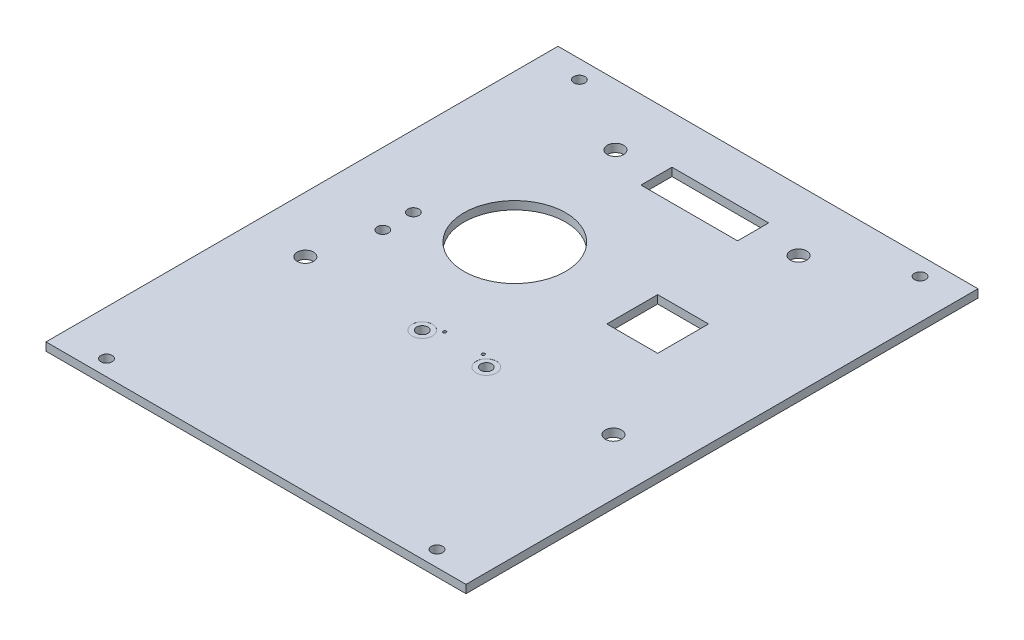
ISO-10303-21;
HEADER;
FILE_DESCRIPTION(('STEP AP214'),'2;1');
FILE_NAME('part.step','',(''),(''),'','','');
FILE_SCHEMA(('AUTOMOTIVE_DESIGN { 1 0 10303 214 1 1 1 1 }'));
ENDSEC;
DATA;
#1=APPLICATION_CONTEXT('core data for automotive mechanical design processes');
#2=APPLICATION_PROTOCOL_DEFINITION('international standard','automotive_design',2000,#1);
#3=PRODUCT_CONTEXT('',#1,'mechanical');
#4=PRODUCT('Part','Part','',(#3));
#5=PRODUCT_RELATED_PRODUCT_CATEGORY('part','',(#4));
#6=PRODUCT_DEFINITION_FORMATION('','',#4);
#7=PRODUCT_DEFINITION_CONTEXT('part definition',#1,'design');
#8=PRODUCT_DEFINITION('design','',#6,#7);
#9=PRODUCT_DEFINITION_SHAPE('','',#8);
#10=(LENGTH_UNIT() NAMED_UNIT(*) SI_UNIT(.MILLI.,.METRE.));
#11=(NAMED_UNIT(*) PLANE_ANGLE_UNIT() SI_UNIT($,.RADIAN.));
#12=(NAMED_UNIT(*) SI_UNIT($,.STERADIAN.) SOLID_ANGLE_UNIT());
#13=UNCERTAINTY_MEASURE_WITH_UNIT(LENGTH_MEASURE(1.E-05),#10,'distance_accuracy_value','');
#14=(GEOMETRIC_REPRESENTATION_CONTEXT(3) GLOBAL_UNCERTAINTY_ASSIGNED_CONTEXT((#13)) GLOBAL_UNIT_ASSIGNED_CONTEXT((#10,
#11,#12)) REPRESENTATION_CONTEXT('',''));
#15=CARTESIAN_POINT('',(0.,0.,0.));
#16=DIRECTION('',(0.,0.,1.));
#17=DIRECTION('',(1.,0.,0.));
#18=AXIS2_PLACEMENT_3D('',#15,#16,#17);
#19=CARTESIAN_POINT('',(17.44,-8.4,30.2374526378947));
#20=DIRECTION('',(0.,1.,0.));
#21=DIRECTION('',(0.,0.,1.));
#22=AXIS2_PLACEMENT_3D('',#19,#20,#21);
#23=CYLINDRICAL_SURFACE('',#22,1.1);
#24=CARTESIAN_POINT('',(17.44,0.,30.2374526378947));
#25=DIRECTION('',(0.,-1.,0.));
#26=DIRECTION('',(0.,0.,-1.));
#27=AXIS2_PLACEMENT_3D('',#24,#25,#26);
#28=CIRCLE('',#27,1.1);
#29=CARTESIAN_POINT('',(17.44,0.,29.1374526378947));
#30=VERTEX_POINT('',#29);
#31=EDGE_CURVE('E261',#30,#30,#28,.T.);
#32=ORIENTED_EDGE('',*,*,#31,.T.);
#33=EDGE_LOOP('',(#32));
#34=FACE_BOUND('',#33,.T.);
#35=CARTESIAN_POINT('',(17.44,1.59,30.2374526378947));
#36=DIRECTION('',(0.,1.,0.));
#37=DIRECTION('',(0.,0.,1.));
#38=AXIS2_PLACEMENT_3D('',#35,#36,#37);
#39=CIRCLE('',#38,1.1);
#40=CARTESIAN_POINT('',(17.44,1.59,31.3374526378947));
#41=VERTEX_POINT('',#40);
#42=EDGE_CURVE('E265',#41,#41,#39,.F.);
#43=ORIENTED_EDGE('',*,*,#42,.F.);
#44=EDGE_LOOP('',(#43));
#45=FACE_BOUND('',#44,.T.);
#46=ADVANCED_FACE('F34',(#34,#45),#23,.F.);
#47=CARTESIAN_POINT('',(30.04,-8.4,30.2374526378947));
#48=DIRECTION('',(0.,1.,0.));
#49=DIRECTION('',(0.,0.,1.));
#50=AXIS2_PLACEMENT_3D('',#47,#48,#49);
#51=CYLINDRICAL_SURFACE('',#50,1.1);
#52=CARTESIAN_POINT('',(30.04,0.,30.2374526378947));
#53=DIRECTION('',(0.,-1.,0.));
#54=DIRECTION('',(0.,0.,-1.));
#55=AXIS2_PLACEMENT_3D('',#52,#53,#54);
#56=CIRCLE('',#55,1.1);
#57=CARTESIAN_POINT('',(30.04,0.,29.1374526378947));
#58=VERTEX_POINT('',#57);
#59=EDGE_CURVE('E264',#58,#58,#56,.T.);
#60=ORIENTED_EDGE('',*,*,#59,.T.);
#61=EDGE_LOOP('',(#60));
#62=FACE_BOUND('',#61,.T.);
#63=CARTESIAN_POINT('',(30.04,1.59,30.2374526378947));
#64=DIRECTION('',(0.,1.,0.));
#65=DIRECTION('',(0.,0.,1.));
#66=AXIS2_PLACEMENT_3D('',#63,#64,#65);
#67=CIRCLE('',#66,1.1);
#68=CARTESIAN_POINT('',(30.04,1.59,31.3374526378947));
#69=VERTEX_POINT('',#68);
#70=EDGE_CURVE('E269',#69,#69,#67,.F.);
#71=ORIENTED_EDGE('',*,*,#70,.F.);
#72=EDGE_LOOP('',(#71));
#73=FACE_BOUND('',#72,.T.);
#74=ADVANCED_FACE('F342',(#62,#73),#51,.F.);
#75=CARTESIAN_POINT('',(0.,1.6,0.));
#76=DIRECTION('',(0.,-1.,0.));
#77=DIRECTION('',(0.,0.,-1.));
#78=AXIS2_PLACEMENT_3D('',#75,#76,#77);
#79=PLANE('',#78);
#80=CARTESIAN_POINT('',(-3.50999999999996,1.6,11.0374526378947));
#81=DIRECTION('',(0.,1.,0.));
#82=DIRECTION('',(0.,0.,1.));
#83=AXIS2_PLACEMENT_3D('',#80,#81,#82);
#84=CIRCLE('',#83,1.1);
#85=CARTESIAN_POINT('',(-3.50999999999996,1.6,12.1374526378947));
#86=VERTEX_POINT('',#85);
#87=EDGE_CURVE('E276',#86,#86,#84,.T.);
#88=ORIENTED_EDGE('',*,*,#87,.F.);
#89=EDGE_LOOP('',(#88));
#90=FACE_BOUND('',#89,.T.);
#91=CARTESIAN_POINT('',(-3.50999999999996,1.6,17.0374526378947));
#92=DIRECTION('',(0.,1.,0.));
#93=DIRECTION('',(0.,0.,1.));
#94=AXIS2_PLACEMENT_3D('',#91,#92,#93);
#95=CIRCLE('',#94,1.1);
#96=CARTESIAN_POINT('',(-3.50999999999996,1.6,18.1374526378947));
#97=VERTEX_POINT('',#96);
#98=EDGE_CURVE('E282',#97,#97,#95,.T.);
#99=ORIENTED_EDGE('',*,*,#98,.F.);
#100=EDGE_LOOP('',(#99));
#101=FACE_BOUND('',#100,.T.);
#102=CARTESIAN_POINT('',(30.04,1.6,30.2374526378947));
#103=DIRECTION('',(0.,1.,0.));
#104=DIRECTION('',(0.,0.,1.));
#105=AXIS2_PLACEMENT_3D('',#102,#103,#104);
#106=CIRCLE('',#105,2.);
#107=CARTESIAN_POINT('',(30.04,1.6,32.2374526378947));
#108=VERTEX_POINT('',#107);
#109=EDGE_CURVE('E291',#108,#108,#106,.T.);
#110=ORIENTED_EDGE('',*,*,#109,.F.);
#111=EDGE_LOOP('',(#110));
#112=FACE_BOUND('',#111,.T.);
#113=CARTESIAN_POINT('',(17.44,1.6,30.2374526378947));
#114=DIRECTION('',(0.,1.,0.));
#115=DIRECTION('',(0.,0.,1.));
#116=AXIS2_PLACEMENT_3D('',#113,#114,#115);
#117=CIRCLE('',#116,2.);
#118=CARTESIAN_POINT('',(17.44,1.6,32.2374526378947));
#119=VERTEX_POINT('',#118);
#120=EDGE_CURVE('E280',#119,#119,#117,.T.);
#121=ORIENTED_EDGE('',*,*,#120,.F.);
#122=EDGE_LOOP('',(#121));
#123=FACE_BOUND('',#122,.T.);
#124=CARTESIAN_POINT('',(27.54,1.6,28.3374526378947));
#125=DIRECTION('',(0.,1.,0.));
#126=DIRECTION('',(0.,0.,1.));
#127=AXIS2_PLACEMENT_3D('',#124,#125,#126);
#128=CIRCLE('',#127,0.300000000000001);
#129=CARTESIAN_POINT('',(27.54,1.6,28.6374526378947));
#130=VERTEX_POINT('',#129);
#131=EDGE_CURVE('E257',#130,#130,#128,.T.);
#132=ORIENTED_EDGE('',*,*,#131,.F.);
#133=EDGE_LOOP('',(#132));
#134=FACE_BOUND('',#133,.T.);
#135=CARTESIAN_POINT('',(19.94,1.6,28.3374526378947));
#136=DIRECTION('',(0.,1.,0.));
#137=DIRECTION('',(0.,0.,1.));
#138=AXIS2_PLACEMENT_3D('',#135,#136,#137);
#139=CIRCLE('',#138,0.300000000000001);
#140=CARTESIAN_POINT('',(19.94,1.6,28.6374526378947));
#141=VERTEX_POINT('',#140);
#142=EDGE_CURVE('E268',#141,#141,#139,.T.);
#143=ORIENTED_EDGE('',*,*,#142,.F.);
#144=EDGE_LOOP('',(#143));
#145=FACE_BOUND('',#144,.T.);
#146=CARTESIAN_POINT('',(5.74000000000004,1.6,-19.4625473621052));
#147=DIRECTION('',(0.,-1.,0.));
#148=DIRECTION('',(0.,0.,-1.));
#149=AXIS2_PLACEMENT_3D('',#146,#147,#148);
#150=CIRCLE('',#149,1.6);
#151=CARTESIAN_POINT('',(5.74000000000004,1.6,-21.0625473621052));
#152=VERTEX_POINT('',#151);
#153=EDGE_CURVE('E305',#152,#152,#150,.T.);
#154=ORIENTED_EDGE('',*,*,#153,.T.);
#155=EDGE_LOOP('',(#154));
#156=FACE_BOUND('',#155,.T.);
#157=CARTESIAN_POINT('',(41.74,1.6,-19.4625473621052));
#158=DIRECTION('',(0.,-1.,0.));
#159=DIRECTION('',(0.,0.,-1.));
#160=AXIS2_PLACEMENT_3D('',#157,#158,#159);
#161=CIRCLE('',#160,1.6);
#162=CARTESIAN_POINT('',(41.74,1.6,-21.0625473621052));
#163=VERTEX_POINT('',#162);
#164=EDGE_CURVE('E311',#163,#163,#161,.T.);
#165=ORIENTED_EDGE('',*,*,#164,.T.);
#166=EDGE_LOOP('',(#165));
#167=FACE_BOUND('',#166,.T.);
#168=CARTESIAN_POINT('',(-6.55999999999996,1.6,29.2374526378947));
#169=DIRECTION('',(0.,-1.,0.));
#170=DIRECTION('',(0.,0.,-1.));
#171=AXIS2_PLACEMENT_3D('',#168,#169,#170);
#172=CIRCLE('',#171,1.60000000000001);
#173=CARTESIAN_POINT('',(-6.55999999999996,1.6,27.6374526378947));
#174=VERTEX_POINT('',#173);
#175=EDGE_CURVE('E317',#174,#174,#172,.T.);
#176=ORIENTED_EDGE('',*,*,#175,.T.);
#177=EDGE_LOOP('',(#176));
#178=FACE_BOUND('',#177,.T.);
#179=CARTESIAN_POINT('',(54.04,1.6,29.2374526378947));
#180=DIRECTION('',(0.,-1.,0.));
#181=DIRECTION('',(0.,0.,-1.));
#182=AXIS2_PLACEMENT_3D('',#179,#180,#181);
#183=CIRCLE('',#182,1.6);
#184=CARTESIAN_POINT('',(54.04,1.6,27.6374526378947));
#185=VERTEX_POINT('',#184);
#186=EDGE_CURVE('E149',#185,#185,#183,.T.);
#187=ORIENTED_EDGE('',*,*,#186,.T.);
#188=EDGE_LOOP('',(#187));
#189=FACE_BOUND('',#188,.T.);
#190=DIRECTION('',(-1.,0.,0.));
#191=VECTOR('',#190,1.);
#192=CARTESIAN_POINT('',(33.24,1.6,-15.9775473621052));
#193=LINE('',#192,#191);
#194=CARTESIAN_POINT('',(33.24,1.6,-15.9775473621052));
#195=VERTEX_POINT('',#194);
#196=CARTESIAN_POINT('',(14.24,1.6,-15.9775473621052));
#197=VERTEX_POINT('',#196);
#198=EDGE_CURVE('E133',#195,#197,#193,.T.);
#199=ORIENTED_EDGE('',*,*,#198,.T.);
#200=DIRECTION('',(0.,0.,-1.));
#201=VECTOR('',#200,1.);
#202=CARTESIAN_POINT('',(14.24,1.6,-15.9775473621052));
#203=LINE('',#202,#201);
#204=CARTESIAN_POINT('',(14.24,1.6,-22.0775473621052));
#205=VERTEX_POINT('',#204);
#206=EDGE_CURVE('E127',#197,#205,#203,.T.);
#207=ORIENTED_EDGE('',*,*,#206,.T.);
#208=DIRECTION('',(1.,0.,0.));
#209=VECTOR('',#208,1.);
#210=CARTESIAN_POINT('',(33.24,1.6,-22.0775473621052));
#211=LINE('',#210,#209);
#212=CARTESIAN_POINT('',(33.24,1.6,-22.0775473621052));
#213=VERTEX_POINT('',#212);
#214=EDGE_CURVE('E136',#205,#213,#211,.T.);
#215=ORIENTED_EDGE('',*,*,#214,.T.);
#216=DIRECTION('',(0.,0.,1.));
#217=VECTOR('',#216,1.);
#218=CARTESIAN_POINT('',(33.24,1.6,-15.9775473621052));
#219=LINE('',#218,#217);
#220=EDGE_CURVE('E51',#213,#195,#219,.T.);
#221=ORIENTED_EDGE('',*,*,#220,.T.);
#222=EDGE_LOOP('',(#199,#207,#215,#221));
#223=FACE_BOUND('',#222,.T.);
#224=DIRECTION('',(-1.,0.,0.));
#225=VECTOR('',#224,1.);
#226=CARTESIAN_POINT('',(0.,1.6,11.0374526378948));
#227=LINE('',#226,#225);
#228=CARTESIAN_POINT('',(44.54,1.6,11.0374526378948));
#229=VERTEX_POINT('',#228);
#230=CARTESIAN_POINT('',(34.54,1.6,11.0374526378948));
#231=VERTEX_POINT('',#230);
#232=EDGE_CURVE('E190',#229,#231,#227,.T.);
#233=ORIENTED_EDGE('',*,*,#232,.T.);
#234=DIRECTION('',(0.,0.,-1.));
#235=VECTOR('',#234,1.);
#236=CARTESIAN_POINT('',(34.54,1.6,0.));
#237=LINE('',#236,#235);
#238=CARTESIAN_POINT('',(34.54,1.6,1.03745263789475));
#239=VERTEX_POINT('',#238);
#240=EDGE_CURVE('E193',#231,#239,#237,.T.);
#241=ORIENTED_EDGE('',*,*,#240,.T.);
#242=DIRECTION('',(1.,0.,0.));
#243=VECTOR('',#242,1.);
#244=CARTESIAN_POINT('',(0.,1.6,1.03745263789474));
#245=LINE('',#244,#243);
#246=CARTESIAN_POINT('',(44.54,1.6,1.03745263789475));
#247=VERTEX_POINT('',#246);
#248=EDGE_CURVE('E178',#239,#247,#245,.T.);
#249=ORIENTED_EDGE('',*,*,#248,.T.);
#250=DIRECTION('',(0.,0.,1.));
#251=VECTOR('',#250,1.);
#252=CARTESIAN_POINT('',(44.54,1.6,0.));
#253=LINE('',#252,#251);
#254=EDGE_CURVE('E187',#247,#229,#253,.T.);
#255=ORIENTED_EDGE('',*,*,#254,.T.);
#256=EDGE_LOOP('',(#233,#241,#249,#255));
#257=FACE_BOUND('',#256,.T.);
#258=CARTESIAN_POINT('',(-8.75999999999998,1.6,66.1374526378947));
#259=DIRECTION('',(0.,1.,0.));
#260=DIRECTION('',(0.,0.,1.));
#261=AXIS2_PLACEMENT_3D('',#258,#259,#260);
#262=CIRCLE('',#261,1.1);
#263=CARTESIAN_POINT('',(-8.75999999999998,1.6,67.2374526378947));
#264=VERTEX_POINT('',#263);
#265=EDGE_CURVE('E215',#264,#264,#262,.T.);
#266=ORIENTED_EDGE('',*,*,#265,.F.);
#267=EDGE_LOOP('',(#266));
#268=FACE_BOUND('',#267,.T.);
#269=CARTESIAN_POINT('',(56.24,1.6,66.1374526378947));
#270=DIRECTION('',(0.,1.,0.));
#271=DIRECTION('',(0.,0.,1.));
#272=AXIS2_PLACEMENT_3D('',#269,#270,#271);
#273=CIRCLE('',#272,1.1);
#274=CARTESIAN_POINT('',(56.24,1.6,67.2374526378947));
#275=VERTEX_POINT('',#274);
#276=EDGE_CURVE('E223',#275,#275,#273,.T.);
#277=ORIENTED_EDGE('',*,*,#276,.F.);
#278=EDGE_LOOP('',(#277));
#279=FACE_BOUND('',#278,.T.);
#280=CARTESIAN_POINT('',(11.54,1.6,6.13745263789474));
#281=DIRECTION('',(0.,-1.,0.));
#282=DIRECTION('',(0.,0.,-1.));
#283=AXIS2_PLACEMENT_3D('',#280,#281,#282);
#284=CIRCLE('',#283,10.);
#285=CARTESIAN_POINT('',(11.54,1.6,-3.86254736210526));
#286=VERTEX_POINT('',#285);
#287=EDGE_CURVE('E240',#286,#286,#284,.T.);
#288=ORIENTED_EDGE('',*,*,#287,.T.);
#289=EDGE_LOOP('',(#288));
#290=FACE_BOUND('',#289,.T.);
#291=CARTESIAN_POINT('',(57.24,1.6,-27.8625473621053));
#292=DIRECTION('',(0.,1.,0.));
#293=DIRECTION('',(0.,0.,1.));
#294=AXIS2_PLACEMENT_3D('',#291,#292,#293);
#295=CIRCLE('',#294,1.1);
#296=CARTESIAN_POINT('',(57.24,1.6,-26.7625473621053));
#297=VERTEX_POINT('',#296);
#298=EDGE_CURVE('E243',#297,#297,#295,.T.);
#299=ORIENTED_EDGE('',*,*,#298,.F.);
#300=EDGE_LOOP('',(#299));
#301=FACE_BOUND('',#300,.T.);
#302=CARTESIAN_POINT('',(-9.75999999999997,1.6,-27.8625473621053));
#303=DIRECTION('',(0.,1.,0.));
#304=DIRECTION('',(0.,0.,1.));
#305=AXIS2_PLACEMENT_3D('',#302,#303,#304);
#306=CIRCLE('',#305,1.1);
#307=CARTESIAN_POINT('',(-9.75999999999997,1.6,-26.7625473621053));
#308=VERTEX_POINT('',#307);
#309=EDGE_CURVE('E43',#308,#308,#306,.T.);
#310=ORIENTED_EDGE('',*,*,#309,.F.);
#311=EDGE_LOOP('',(#310));
#312=FACE_BOUND('',#311,.T.);
#313=DIRECTION('',(1.,0.,0.));
#314=VECTOR('',#313,1.);
#315=CARTESIAN_POINT('',(-17.76,1.6,-31.4625473621053));
#316=LINE('',#315,#314);
#317=CARTESIAN_POINT('',(-17.56,1.6,-31.4625473621053));
#318=VERTEX_POINT('',#317);
#319=CARTESIAN_POINT('',(65.04,1.6,-31.4625473621052));
#320=VERTEX_POINT('',#319);
#321=EDGE_CURVE('E234',#318,#320,#316,.T.);
#322=ORIENTED_EDGE('',*,*,#321,.F.);
#323=DIRECTION('',(0.,0.,1.));
#324=VECTOR('',#323,1.);
#325=CARTESIAN_POINT('',(-17.56,1.6,69.2374526378947));
#326=LINE('',#325,#324);
#327=CARTESIAN_POINT('',(-17.56,1.6,69.2374526378947));
#328=VERTEX_POINT('',#327);
#329=EDGE_CURVE('E197',#318,#328,#326,.T.);
#330=ORIENTED_EDGE('',*,*,#329,.T.);
#331=DIRECTION('',(-1.,0.,0.));
#332=VECTOR('',#331,1.);
#333=CARTESIAN_POINT('',(65.24,1.6,69.2374526378947));
#334=LINE('',#333,#332);
#335=CARTESIAN_POINT('',(65.04,1.6,69.2374526378947));
#336=VERTEX_POINT('',#335);
#337=EDGE_CURVE('E229',#336,#328,#334,.T.);
#338=ORIENTED_EDGE('',*,*,#337,.F.);
#339=DIRECTION('',(0.,0.,-1.));
#340=VECTOR('',#339,1.);
#341=CARTESIAN_POINT('',(65.04,1.6,-31.4625473621052));
#342=LINE('',#341,#340);
#343=EDGE_CURVE('E207',#336,#320,#342,.T.);
#344=ORIENTED_EDGE('',*,*,#343,.T.);
#345=EDGE_LOOP('',(#322,#330,#338,#344));
#346=FACE_BOUND('',#345,.T.);
#347=ADVANCED_FACE('F140',(#90,#101,#112,#123,#134,#145,#156,#167,#178,#189,#223,#257,#268,#279,
#290,#301,#312,#346),#79,.F.);
#348=CARTESIAN_POINT('',(0.,0.,0.));
#349=DIRECTION('',(0.,-1.,0.));
#350=DIRECTION('',(0.,0.,-1.));
#351=AXIS2_PLACEMENT_3D('',#348,#349,#350);
#352=PLANE('',#351);
#353=CARTESIAN_POINT('',(-3.50999999999996,0.,11.0374526378947));
#354=DIRECTION('',(0.,-1.,0.));
#355=DIRECTION('',(0.,0.,-1.));
#356=AXIS2_PLACEMENT_3D('',#353,#354,#355);
#357=CIRCLE('',#356,1.1);
#358=CARTESIAN_POINT('',(-3.50999999999996,0.,9.93745263789475));
#359=VERTEX_POINT('',#358);
#360=EDGE_CURVE('E38',#359,#359,#357,.T.);
#361=ORIENTED_EDGE('',*,*,#360,.F.);
#362=EDGE_LOOP('',(#361));
#363=FACE_BOUND('',#362,.T.);
#364=CARTESIAN_POINT('',(-3.50999999999996,0.,17.0374526378947));
#365=DIRECTION('',(0.,-1.,0.));
#366=DIRECTION('',(0.,0.,-1.));
#367=AXIS2_PLACEMENT_3D('',#364,#365,#366);
#368=CIRCLE('',#367,1.1);
#369=CARTESIAN_POINT('',(-3.50999999999996,0.,15.9374526378947));
#370=VERTEX_POINT('',#369);
#371=EDGE_CURVE('E274',#370,#370,#368,.T.);
#372=ORIENTED_EDGE('',*,*,#371,.F.);
#373=EDGE_LOOP('',(#372));
#374=FACE_BOUND('',#373,.T.);
#375=ORIENTED_EDGE('',*,*,#59,.F.);
#376=EDGE_LOOP('',(#375));
#377=FACE_BOUND('',#376,.T.);
#378=ORIENTED_EDGE('',*,*,#31,.F.);
#379=EDGE_LOOP('',(#378));
#380=FACE_BOUND('',#379,.T.);
#381=CARTESIAN_POINT('',(27.54,0.,28.3374526378947));
#382=DIRECTION('',(0.,-1.,0.));
#383=DIRECTION('',(0.,0.,-1.));
#384=AXIS2_PLACEMENT_3D('',#381,#382,#383);
#385=CIRCLE('',#384,0.300000000000001);
#386=CARTESIAN_POINT('',(27.54,0.,28.0374526378947));
#387=VERTEX_POINT('',#386);
#388=EDGE_CURVE('E256',#387,#387,#385,.T.);
#389=ORIENTED_EDGE('',*,*,#388,.F.);
#390=EDGE_LOOP('',(#389));
#391=FACE_BOUND('',#390,.T.);
#392=CARTESIAN_POINT('',(19.94,0.,28.3374526378947));
#393=DIRECTION('',(0.,-1.,0.));
#394=DIRECTION('',(0.,0.,-1.));
#395=AXIS2_PLACEMENT_3D('',#392,#393,#394);
#396=CIRCLE('',#395,0.300000000000001);
#397=CARTESIAN_POINT('',(19.94,0.,28.0374526378947));
#398=VERTEX_POINT('',#397);
#399=EDGE_CURVE('E253',#398,#398,#396,.T.);
#400=ORIENTED_EDGE('',*,*,#399,.F.);
#401=EDGE_LOOP('',(#400));
#402=FACE_BOUND('',#401,.T.);
#403=CARTESIAN_POINT('',(5.74000000000004,0.,-19.4625473621052));
#404=DIRECTION('',(0.,-1.,0.));
#405=DIRECTION('',(0.,0.,-1.));
#406=AXIS2_PLACEMENT_3D('',#403,#404,#405);
#407=CIRCLE('',#406,1.6);
#408=CARTESIAN_POINT('',(5.74000000000004,0.,-21.0625473621052));
#409=VERTEX_POINT('',#408);
#410=EDGE_CURVE('E260',#409,#409,#407,.T.);
#411=ORIENTED_EDGE('',*,*,#410,.F.);
#412=EDGE_LOOP('',(#411));
#413=FACE_BOUND('',#412,.T.);
#414=CARTESIAN_POINT('',(41.74,0.,-19.4625473621052));
#415=DIRECTION('',(0.,-1.,0.));
#416=DIRECTION('',(0.,0.,-1.));
#417=AXIS2_PLACEMENT_3D('',#414,#415,#416);
#418=CIRCLE('',#417,1.6);
#419=CARTESIAN_POINT('',(41.74,0.,-21.0625473621052));
#420=VERTEX_POINT('',#419);
#421=EDGE_CURVE('E308',#420,#420,#418,.T.);
#422=ORIENTED_EDGE('',*,*,#421,.F.);
#423=EDGE_LOOP('',(#422));
#424=FACE_BOUND('',#423,.T.);
#425=CARTESIAN_POINT('',(-6.55999999999996,0.,29.2374526378947));
#426=DIRECTION('',(0.,-1.,0.));
#427=DIRECTION('',(0.,0.,-1.));
#428=AXIS2_PLACEMENT_3D('',#425,#426,#427);
#429=CIRCLE('',#428,1.60000000000001);
#430=CARTESIAN_POINT('',(-6.55999999999996,0.,27.6374526378947));
#431=VERTEX_POINT('',#430);
#432=EDGE_CURVE('E314',#431,#431,#429,.T.);
#433=ORIENTED_EDGE('',*,*,#432,.F.);
#434=EDGE_LOOP('',(#433));
#435=FACE_BOUND('',#434,.T.);
#436=CARTESIAN_POINT('',(54.04,0.,29.2374526378947));
#437=DIRECTION('',(0.,-1.,0.));
#438=DIRECTION('',(0.,0.,-1.));
#439=AXIS2_PLACEMENT_3D('',#436,#437,#438);
#440=CIRCLE('',#439,1.6);
#441=CARTESIAN_POINT('',(54.04,0.,27.6374526378947));
#442=VERTEX_POINT('',#441);
#443=EDGE_CURVE('E319',#442,#442,#440,.T.);
#444=ORIENTED_EDGE('',*,*,#443,.F.);
#445=EDGE_LOOP('',(#444));
#446=FACE_BOUND('',#445,.T.);
#447=DIRECTION('',(0.,0.,-1.));
#448=VECTOR('',#447,1.);
#449=CARTESIAN_POINT('',(14.24,0.,-15.9775473621052));
#450=LINE('',#449,#448);
#451=CARTESIAN_POINT('',(14.24,0.,-15.9775473621052));
#452=VERTEX_POINT('',#451);
#453=CARTESIAN_POINT('',(14.24,0.,-22.0775473621052));
#454=VERTEX_POINT('',#453);
#455=EDGE_CURVE('E59',#452,#454,#450,.T.);
#456=ORIENTED_EDGE('',*,*,#455,.F.);
#457=DIRECTION('',(-1.,0.,0.));
#458=VECTOR('',#457,1.);
#459=CARTESIAN_POINT('',(33.24,0.,-15.9775473621052));
#460=LINE('',#459,#458);
#461=CARTESIAN_POINT('',(33.24,0.,-15.9775473621052));
#462=VERTEX_POINT('',#461);
#463=EDGE_CURVE('E143',#462,#452,#460,.T.);
#464=ORIENTED_EDGE('',*,*,#463,.F.);
#465=DIRECTION('',(0.,0.,1.));
#466=VECTOR('',#465,1.);
#467=CARTESIAN_POINT('',(33.24,0.,-15.9775473621052));
#468=LINE('',#467,#466);
#469=CARTESIAN_POINT('',(33.24,0.,-22.0775473621052));
#470=VERTEX_POINT('',#469);
#471=EDGE_CURVE('E146',#470,#462,#468,.T.);
#472=ORIENTED_EDGE('',*,*,#471,.F.);
#473=DIRECTION('',(1.,0.,0.));
#474=VECTOR('',#473,1.);
#475=CARTESIAN_POINT('',(33.24,0.,-22.0775473621052));
#476=LINE('',#475,#474);
#477=EDGE_CURVE('E155',#454,#470,#476,.T.);
#478=ORIENTED_EDGE('',*,*,#477,.F.);
#479=EDGE_LOOP('',(#456,#464,#472,#478));
#480=FACE_BOUND('',#479,.T.);
#481=DIRECTION('',(0.,0.,-1.));
#482=VECTOR('',#481,1.);
#483=CARTESIAN_POINT('',(34.54,0.,1.03745263789475));
#484=LINE('',#483,#482);
#485=CARTESIAN_POINT('',(34.54,0.,11.0374526378948));
#486=VERTEX_POINT('',#485);
#487=CARTESIAN_POINT('',(34.54,0.,1.03745263789475));
#488=VERTEX_POINT('',#487);
#489=EDGE_CURVE('E161',#486,#488,#484,.T.);
#490=ORIENTED_EDGE('',*,*,#489,.F.);
#491=DIRECTION('',(-1.,0.,0.));
#492=VECTOR('',#491,1.);
#493=CARTESIAN_POINT('',(44.54,0.,11.0374526378948));
#494=LINE('',#493,#492);
#495=CARTESIAN_POINT('',(44.54,0.,11.0374526378948));
#496=VERTEX_POINT('',#495);
#497=EDGE_CURVE('E172',#496,#486,#494,.T.);
#498=ORIENTED_EDGE('',*,*,#497,.F.);
#499=DIRECTION('',(0.,0.,1.));
#500=VECTOR('',#499,1.);
#501=CARTESIAN_POINT('',(44.54,0.,1.03745263789475));
#502=LINE('',#501,#500);
#503=CARTESIAN_POINT('',(44.54,0.,1.03745263789475));
#504=VERTEX_POINT('',#503);
#505=EDGE_CURVE('E169',#504,#496,#502,.T.);
#506=ORIENTED_EDGE('',*,*,#505,.F.);
#507=DIRECTION('',(1.,0.,0.));
#508=VECTOR('',#507,1.);
#509=CARTESIAN_POINT('',(44.54,0.,1.03745263789475));
#510=LINE('',#509,#508);
#511=EDGE_CURVE('E166',#488,#504,#510,.T.);
#512=ORIENTED_EDGE('',*,*,#511,.F.);
#513=EDGE_LOOP('',(#490,#498,#506,#512));
#514=FACE_BOUND('',#513,.T.);
#515=DIRECTION('',(0.,0.,1.));
#516=VECTOR('',#515,1.);
#517=CARTESIAN_POINT('',(-17.56,0.,69.2374526378947));
#518=LINE('',#517,#516);
#519=CARTESIAN_POINT('',(-17.56,0.,-31.4625473621053));
#520=VERTEX_POINT('',#519);
#521=CARTESIAN_POINT('',(-17.56,0.,69.2374526378947));
#522=VERTEX_POINT('',#521);
#523=EDGE_CURVE('E196',#520,#522,#518,.T.);
#524=ORIENTED_EDGE('',*,*,#523,.F.);
#525=DIRECTION('',(-1.,0.,0.));
#526=VECTOR('',#525,1.);
#527=CARTESIAN_POINT('',(-17.76,0.,-31.4625473621053));
#528=LINE('',#527,#526);
#529=CARTESIAN_POINT('',(65.04,0.,-31.4625473621052));
#530=VERTEX_POINT('',#529);
#531=EDGE_CURVE('E236',#530,#520,#528,.T.);
#532=ORIENTED_EDGE('',*,*,#531,.F.);
#533=DIRECTION('',(0.,0.,-1.));
#534=VECTOR('',#533,1.);
#535=CARTESIAN_POINT('',(65.04,0.,-31.4625473621052));
#536=LINE('',#535,#534);
#537=CARTESIAN_POINT('',(65.04,0.,69.2374526378947));
#538=VERTEX_POINT('',#537);
#539=EDGE_CURVE('E205',#538,#530,#536,.T.);
#540=ORIENTED_EDGE('',*,*,#539,.F.);
#541=DIRECTION('',(1.,0.,0.));
#542=VECTOR('',#541,1.);
#543=CARTESIAN_POINT('',(65.24,0.,69.2374526378947));
#544=LINE('',#543,#542);
#545=EDGE_CURVE('E232',#522,#538,#544,.T.);
#546=ORIENTED_EDGE('',*,*,#545,.F.);
#547=EDGE_LOOP('',(#524,#532,#540,#546));
#548=FACE_BOUND('',#547,.T.);
#549=CARTESIAN_POINT('',(-8.75999999999998,0.,66.1374526378947));
#550=DIRECTION('',(0.,1.,0.));
#551=DIRECTION('',(0.,0.,1.));
#552=AXIS2_PLACEMENT_3D('',#549,#550,#551);
#553=CIRCLE('',#552,1.1);
#554=CARTESIAN_POINT('',(-8.75999999999998,0.,67.2374526378947));
#555=VERTEX_POINT('',#554);
#556=EDGE_CURVE('E220',#555,#555,#553,.T.);
#557=ORIENTED_EDGE('',*,*,#556,.T.);
#558=EDGE_LOOP('',(#557));
#559=FACE_BOUND('',#558,.T.);
#560=CARTESIAN_POINT('',(56.24,0.,66.1374526378947));
#561=DIRECTION('',(0.,1.,0.));
#562=DIRECTION('',(0.,0.,1.));
#563=AXIS2_PLACEMENT_3D('',#560,#561,#562);
#564=CIRCLE('',#563,1.1);
#565=CARTESIAN_POINT('',(56.24,0.,67.2374526378947));
#566=VERTEX_POINT('',#565);
#567=EDGE_CURVE('E226',#566,#566,#564,.T.);
#568=ORIENTED_EDGE('',*,*,#567,.T.);
#569=EDGE_LOOP('',(#568));
#570=FACE_BOUND('',#569,.T.);
#571=CARTESIAN_POINT('',(11.54,0.,6.13745263789474));
#572=DIRECTION('',(0.,-1.,0.));
#573=DIRECTION('',(0.,0.,-1.));
#574=AXIS2_PLACEMENT_3D('',#571,#572,#573);
#575=CIRCLE('',#574,10.);
#576=CARTESIAN_POINT('',(11.54,0.,-3.86254736210526));
#577=VERTEX_POINT('',#576);
#578=EDGE_CURVE('E239',#577,#577,#575,.T.);
#579=ORIENTED_EDGE('',*,*,#578,.F.);
#580=EDGE_LOOP('',(#579));
#581=FACE_BOUND('',#580,.T.);
#582=CARTESIAN_POINT('',(57.24,0.,-27.8625473621053));
#583=DIRECTION('',(0.,-1.,0.));
#584=DIRECTION('',(0.,0.,-1.));
#585=AXIS2_PLACEMENT_3D('',#582,#583,#584);
#586=CIRCLE('',#585,1.1);
#587=CARTESIAN_POINT('',(57.24,0.,-28.9625473621053));
#588=VERTEX_POINT('',#587);
#589=EDGE_CURVE('E248',#588,#588,#586,.T.);
#590=ORIENTED_EDGE('',*,*,#589,.F.);
#591=EDGE_LOOP('',(#590));
#592=FACE_BOUND('',#591,.T.);
#593=CARTESIAN_POINT('',(-9.75999999999997,0.,-27.8625473621053));
#594=DIRECTION('',(0.,-1.,0.));
#595=DIRECTION('',(0.,0.,-1.));
#596=AXIS2_PLACEMENT_3D('',#593,#594,#595);
#597=CIRCLE('',#596,1.1);
#598=CARTESIAN_POINT('',(-9.75999999999997,0.,-28.9625473621053));
#599=VERTEX_POINT('',#598);
#600=EDGE_CURVE('E11',#599,#599,#597,.T.);
#601=ORIENTED_EDGE('',*,*,#600,.F.);
#602=EDGE_LOOP('',(#601));
#603=FACE_BOUND('',#602,.T.);
#604=ADVANCED_FACE('F36',(#363,#374,#377,#380,#391,#402,#413,#424,#435,#446,#480,#514,#548,#559,
#570,#581,#592,#603),#352,.T.);
#605=CARTESIAN_POINT('',(-9.75999999999997,1.6,-27.8625473621053));
#606=DIRECTION('',(0.,1.,0.));
#607=DIRECTION('',(0.,0.,1.));
#608=AXIS2_PLACEMENT_3D('',#605,#606,#607);
#609=CYLINDRICAL_SURFACE('',#608,1.1);
#610=ORIENTED_EDGE('',*,*,#600,.T.);
#611=EDGE_LOOP('',(#610));
#612=FACE_BOUND('',#611,.T.);
#613=ORIENTED_EDGE('',*,*,#309,.T.);
#614=EDGE_LOOP('',(#613));
#615=FACE_BOUND('',#614,.T.);
#616=ADVANCED_FACE('F382',(#612,#615),#609,.F.);
#617=CARTESIAN_POINT('',(57.24,1.6,-27.8625473621053));
#618=DIRECTION('',(0.,1.,0.));
#619=DIRECTION('',(0.,0.,1.));
#620=AXIS2_PLACEMENT_3D('',#617,#618,#619);
#621=CYLINDRICAL_SURFACE('',#620,1.1);
#622=ORIENTED_EDGE('',*,*,#589,.T.);
#623=EDGE_LOOP('',(#622));
#624=FACE_BOUND('',#623,.T.);
#625=ORIENTED_EDGE('',*,*,#298,.T.);
#626=EDGE_LOOP('',(#625));
#627=FACE_BOUND('',#626,.T.);
#628=ADVANCED_FACE('F388',(#624,#627),#621,.F.);
#629=CARTESIAN_POINT('',(11.54,1.6,6.13745263789474));
#630=DIRECTION('',(0.,-1.,0.));
#631=DIRECTION('',(0.,0.,-1.));
#632=AXIS2_PLACEMENT_3D('',#629,#630,#631);
#633=CYLINDRICAL_SURFACE('',#632,10.);
#634=ORIENTED_EDGE('',*,*,#287,.F.);
#635=EDGE_LOOP('',(#634));
#636=FACE_BOUND('',#635,.T.);
#637=ORIENTED_EDGE('',*,*,#578,.T.);
#638=EDGE_LOOP('',(#637));
#639=FACE_BOUND('',#638,.T.);
#640=ADVANCED_FACE('F392',(#636,#639),#633,.F.);
#641=CARTESIAN_POINT('',(0.,0.,-31.4625473621053));
#642=DIRECTION('',(0.,0.,1.));
#643=DIRECTION('',(1.,0.,0.));
#644=AXIS2_PLACEMENT_3D('',#641,#642,#643);
#645=PLANE('',#644);
#646=ORIENTED_EDGE('',*,*,#531,.T.);
#647=DIRECTION('',(0.,-1.,0.));
#648=VECTOR('',#647,1.);
#649=CARTESIAN_POINT('',(-17.56,1.6,-31.4625473621053));
#650=LINE('',#649,#648);
#651=EDGE_CURVE('E200',#318,#520,#650,.T.);
#652=ORIENTED_EDGE('',*,*,#651,.F.);
#653=ORIENTED_EDGE('',*,*,#321,.T.);
#654=DIRECTION('',(0.,-1.,0.));
#655=VECTOR('',#654,1.);
#656=CARTESIAN_POINT('',(65.04,1.6,-31.4625473621052));
#657=LINE('',#656,#655);
#658=EDGE_CURVE('E212',#320,#530,#657,.T.);
#659=ORIENTED_EDGE('',*,*,#658,.T.);
#660=EDGE_LOOP('',(#646,#652,#653,#659));
#661=FACE_BOUND('',#660,.T.);
#662=ADVANCED_FACE('F396',(#661),#645,.F.);
#663=CARTESIAN_POINT('',(0.,0.,69.2374526378947));
#664=DIRECTION('',(0.,0.,-1.));
#665=DIRECTION('',(-1.,0.,0.));
#666=AXIS2_PLACEMENT_3D('',#663,#664,#665);
#667=PLANE('',#666);
#668=ORIENTED_EDGE('',*,*,#337,.T.);
#669=DIRECTION('',(0.,-1.,0.));
#670=VECTOR('',#669,1.);
#671=CARTESIAN_POINT('',(-17.56,1.6,69.2374526378947));
#672=LINE('',#671,#670);
#673=EDGE_CURVE('E202',#328,#522,#672,.T.);
#674=ORIENTED_EDGE('',*,*,#673,.T.);
#675=ORIENTED_EDGE('',*,*,#545,.T.);
#676=DIRECTION('',(0.,-1.,0.));
#677=VECTOR('',#676,1.);
#678=CARTESIAN_POINT('',(65.04,1.6,69.2374526378947));
#679=LINE('',#678,#677);
#680=EDGE_CURVE('E210',#336,#538,#679,.T.);
#681=ORIENTED_EDGE('',*,*,#680,.F.);
#682=EDGE_LOOP('',(#668,#674,#675,#681));
#683=FACE_BOUND('',#682,.T.);
#684=ADVANCED_FACE('F400',(#683),#667,.F.);
#685=CARTESIAN_POINT('',(56.24,1.6,66.1374526378947));
#686=DIRECTION('',(0.,1.,0.));
#687=DIRECTION('',(0.,0.,1.));
#688=AXIS2_PLACEMENT_3D('',#685,#686,#687);
#689=CYLINDRICAL_SURFACE('',#688,1.1);
#690=ORIENTED_EDGE('',*,*,#567,.F.);
#691=EDGE_LOOP('',(#690));
#692=FACE_BOUND('',#691,.T.);
#693=ORIENTED_EDGE('',*,*,#276,.T.);
#694=EDGE_LOOP('',(#693));
#695=FACE_BOUND('',#694,.T.);
#696=ADVANCED_FACE('F404',(#692,#695),#689,.F.);
#697=CARTESIAN_POINT('',(-8.75999999999998,1.6,66.1374526378947));
#698=DIRECTION('',(0.,1.,0.));
#699=DIRECTION('',(0.,0.,1.));
#700=AXIS2_PLACEMENT_3D('',#697,#698,#699);
#701=CYLINDRICAL_SURFACE('',#700,1.1);
#702=ORIENTED_EDGE('',*,*,#556,.F.);
#703=EDGE_LOOP('',(#702));
#704=FACE_BOUND('',#703,.T.);
#705=ORIENTED_EDGE('',*,*,#265,.T.);
#706=EDGE_LOOP('',(#705));
#707=FACE_BOUND('',#706,.T.);
#708=ADVANCED_FACE('F408',(#704,#707),#701,.F.);
#709=CARTESIAN_POINT('',(65.04,1.6,-31.4625473621052));
#710=DIRECTION('',(-1.,0.,0.));
#711=DIRECTION('',(0.,0.,1.));
#712=AXIS2_PLACEMENT_3D('',#709,#710,#711);
#713=PLANE('',#712);
#714=ORIENTED_EDGE('',*,*,#539,.T.);
#715=ORIENTED_EDGE('',*,*,#658,.F.);
#716=ORIENTED_EDGE('',*,*,#343,.F.);
#717=ORIENTED_EDGE('',*,*,#680,.T.);
#718=EDGE_LOOP('',(#714,#715,#716,#717));
#719=FACE_BOUND('',#718,.T.);
#720=ADVANCED_FACE('F412',(#719),#713,.F.);
#721=CARTESIAN_POINT('',(-17.56,1.6,69.2374526378947));
#722=DIRECTION('',(1.,0.,0.));
#723=DIRECTION('',(0.,0.,-1.));
#724=AXIS2_PLACEMENT_3D('',#721,#722,#723);
#725=PLANE('',#724);
#726=ORIENTED_EDGE('',*,*,#523,.T.);
#727=ORIENTED_EDGE('',*,*,#673,.F.);
#728=ORIENTED_EDGE('',*,*,#329,.F.);
#729=ORIENTED_EDGE('',*,*,#651,.T.);
#730=EDGE_LOOP('',(#726,#727,#728,#729));
#731=FACE_BOUND('',#730,.T.);
#732=ADVANCED_FACE('F416',(#731),#725,.F.);
#733=CARTESIAN_POINT('',(34.54,10.,1.03745263789475));
#734=DIRECTION('',(-1.,0.,0.));
#735=DIRECTION('',(0.,0.,1.));
#736=AXIS2_PLACEMENT_3D('',#733,#734,#735);
#737=PLANE('',#736);
#738=DIRECTION('',(0.,-1.,0.));
#739=VECTOR('',#738,1.);
#740=CARTESIAN_POINT('',(34.54,10.,11.0374526378948));
#741=LINE('',#740,#739);
#742=EDGE_CURVE('E176',#231,#486,#741,.T.);
#743=ORIENTED_EDGE('',*,*,#742,.T.);
#744=ORIENTED_EDGE('',*,*,#489,.T.);
#745=DIRECTION('',(0.,-1.,0.));
#746=VECTOR('',#745,1.);
#747=CARTESIAN_POINT('',(34.54,10.,1.03745263789475));
#748=LINE('',#747,#746);
#749=EDGE_CURVE('E175',#239,#488,#748,.T.);
#750=ORIENTED_EDGE('',*,*,#749,.F.);
#751=ORIENTED_EDGE('',*,*,#240,.F.);
#752=EDGE_LOOP('',(#743,#744,#750,#751));
#753=FACE_BOUND('',#752,.T.);
#754=ADVANCED_FACE('F420',(#753),#737,.F.);
#755=CARTESIAN_POINT('',(44.54,10.,11.0374526378948));
#756=DIRECTION('',(0.,0.,1.));
#757=DIRECTION('',(1.,0.,0.));
#758=AXIS2_PLACEMENT_3D('',#755,#756,#757);
#759=PLANE('',#758);
#760=DIRECTION('',(0.,-1.,0.));
#761=VECTOR('',#760,1.);
#762=CARTESIAN_POINT('',(44.54,10.,11.0374526378948));
#763=LINE('',#762,#761);
#764=EDGE_CURVE('E179',#229,#496,#763,.T.);
#765=ORIENTED_EDGE('',*,*,#764,.T.);
#766=ORIENTED_EDGE('',*,*,#497,.T.);
#767=ORIENTED_EDGE('',*,*,#742,.F.);
#768=ORIENTED_EDGE('',*,*,#232,.F.);
#769=EDGE_LOOP('',(#765,#766,#767,#768));
#770=FACE_BOUND('',#769,.T.);
#771=ADVANCED_FACE('F424',(#770),#759,.F.);
#772=CARTESIAN_POINT('',(44.54,10.,1.03745263789475));
#773=DIRECTION('',(1.,0.,0.));
#774=DIRECTION('',(0.,0.,-1.));
#775=AXIS2_PLACEMENT_3D('',#772,#773,#774);
#776=PLANE('',#775);
#777=DIRECTION('',(0.,-1.,0.));
#778=VECTOR('',#777,1.);
#779=CARTESIAN_POINT('',(44.54,10.,1.03745263789475));
#780=LINE('',#779,#778);
#781=EDGE_CURVE('E181',#247,#504,#780,.T.);
#782=ORIENTED_EDGE('',*,*,#781,.T.);
#783=ORIENTED_EDGE('',*,*,#505,.T.);
#784=ORIENTED_EDGE('',*,*,#764,.F.);
#785=ORIENTED_EDGE('',*,*,#254,.F.);
#786=EDGE_LOOP('',(#782,#783,#784,#785));
#787=FACE_BOUND('',#786,.T.);
#788=ADVANCED_FACE('F429',(#787),#776,.F.);
#789=CARTESIAN_POINT('',(44.54,10.,1.03745263789475));
#790=DIRECTION('',(0.,0.,-1.));
#791=DIRECTION('',(-1.,0.,0.));
#792=AXIS2_PLACEMENT_3D('',#789,#790,#791);
#793=PLANE('',#792);
#794=ORIENTED_EDGE('',*,*,#749,.T.);
#795=ORIENTED_EDGE('',*,*,#511,.T.);
#796=ORIENTED_EDGE('',*,*,#781,.F.);
#797=ORIENTED_EDGE('',*,*,#248,.F.);
#798=EDGE_LOOP('',(#794,#795,#796,#797));
#799=FACE_BOUND('',#798,.T.);
#800=ADVANCED_FACE('F426',(#799),#793,.F.);
#801=CARTESIAN_POINT('',(14.24,1.6,-15.9775473621052));
#802=DIRECTION('',(-1.,0.,0.));
#803=DIRECTION('',(0.,0.,1.));
#804=AXIS2_PLACEMENT_3D('',#801,#802,#803);
#805=PLANE('',#804);
#806=ORIENTED_EDGE('',*,*,#455,.T.);
#807=DIRECTION('',(0.,-1.,0.));
#808=VECTOR('',#807,1.);
#809=CARTESIAN_POINT('',(14.24,1.6,-22.0775473621052));
#810=LINE('',#809,#808);
#811=EDGE_CURVE('E123',#205,#454,#810,.T.);
#812=ORIENTED_EDGE('',*,*,#811,.F.);
#813=ORIENTED_EDGE('',*,*,#206,.F.);
#814=DIRECTION('',(0.,-1.,0.));
#815=VECTOR('',#814,1.);
#816=CARTESIAN_POINT('',(14.24,1.6,-15.9775473621052));
#817=LINE('',#816,#815);
#818=EDGE_CURVE('E159',#197,#452,#817,.T.);
#819=ORIENTED_EDGE('',*,*,#818,.T.);
#820=EDGE_LOOP('',(#806,#812,#813,#819));
#821=FACE_BOUND('',#820,.T.);
#822=ADVANCED_FACE('F125',(#821),#805,.F.);
#823=CARTESIAN_POINT('',(33.24,1.6,-15.9775473621052));
#824=DIRECTION('',(0.,0.,1.));
#825=DIRECTION('',(1.,0.,0.));
#826=AXIS2_PLACEMENT_3D('',#823,#824,#825);
#827=PLANE('',#826);
#828=ORIENTED_EDGE('',*,*,#463,.T.);
#829=ORIENTED_EDGE('',*,*,#818,.F.);
#830=ORIENTED_EDGE('',*,*,#198,.F.);
#831=DIRECTION('',(0.,-1.,0.));
#832=VECTOR('',#831,1.);
#833=CARTESIAN_POINT('',(33.24,1.6,-15.9775473621052));
#834=LINE('',#833,#832);
#835=EDGE_CURVE('E162',#195,#462,#834,.T.);
#836=ORIENTED_EDGE('',*,*,#835,.T.);
#837=EDGE_LOOP('',(#828,#829,#830,#836));
#838=FACE_BOUND('',#837,.T.);
#839=ADVANCED_FACE('F438',(#838),#827,.F.);
#840=CARTESIAN_POINT('',(33.24,1.6,-15.9775473621052));
#841=DIRECTION('',(1.,0.,0.));
#842=DIRECTION('',(0.,0.,-1.));
#843=AXIS2_PLACEMENT_3D('',#840,#841,#842);
#844=PLANE('',#843);
#845=ORIENTED_EDGE('',*,*,#471,.T.);
#846=ORIENTED_EDGE('',*,*,#835,.F.);
#847=ORIENTED_EDGE('',*,*,#220,.F.);
#848=DIRECTION('',(0.,-1.,0.));
#849=VECTOR('',#848,1.);
#850=CARTESIAN_POINT('',(33.24,1.6,-22.0775473621052));
#851=LINE('',#850,#849);
#852=EDGE_CURVE('E132',#213,#470,#851,.T.);
#853=ORIENTED_EDGE('',*,*,#852,.T.);
#854=EDGE_LOOP('',(#845,#846,#847,#853));
#855=FACE_BOUND('',#854,.T.);
#856=ADVANCED_FACE('F338',(#855),#844,.F.);
#857=CARTESIAN_POINT('',(33.24,1.6,-22.0775473621052));
#858=DIRECTION('',(0.,0.,-1.));
#859=DIRECTION('',(-1.,0.,0.));
#860=AXIS2_PLACEMENT_3D('',#857,#858,#859);
#861=PLANE('',#860);
#862=ORIENTED_EDGE('',*,*,#477,.T.);
#863=ORIENTED_EDGE('',*,*,#852,.F.);
#864=ORIENTED_EDGE('',*,*,#214,.F.);
#865=ORIENTED_EDGE('',*,*,#811,.T.);
#866=EDGE_LOOP('',(#862,#863,#864,#865));
#867=FACE_BOUND('',#866,.T.);
#868=ADVANCED_FACE('F137',(#867),#861,.F.);
#869=CARTESIAN_POINT('',(54.04,10.,29.2374526378947));
#870=DIRECTION('',(0.,-1.,0.));
#871=DIRECTION('',(0.,0.,-1.));
#872=AXIS2_PLACEMENT_3D('',#869,#870,#871);
#873=CYLINDRICAL_SURFACE('',#872,1.6);
#874=ORIENTED_EDGE('',*,*,#443,.T.);
#875=EDGE_LOOP('',(#874));
#876=FACE_BOUND('',#875,.T.);
#877=ORIENTED_EDGE('',*,*,#186,.F.);
#878=EDGE_LOOP('',(#877));
#879=FACE_BOUND('',#878,.T.);
#880=ADVANCED_FACE('F327',(#876,#879),#873,.F.);
#881=CARTESIAN_POINT('',(-6.55999999999996,10.,29.2374526378947));
#882=DIRECTION('',(0.,-1.,0.));
#883=DIRECTION('',(0.,0.,-1.));
#884=AXIS2_PLACEMENT_3D('',#881,#882,#883);
#885=CYLINDRICAL_SURFACE('',#884,1.60000000000001);
#886=ORIENTED_EDGE('',*,*,#432,.T.);
#887=EDGE_LOOP('',(#886));
#888=FACE_BOUND('',#887,.T.);
#889=ORIENTED_EDGE('',*,*,#175,.F.);
#890=EDGE_LOOP('',(#889));
#891=FACE_BOUND('',#890,.T.);
#892=ADVANCED_FACE('F329',(#888,#891),#885,.F.);
#893=CARTESIAN_POINT('',(41.74,10.,-19.4625473621052));
#894=DIRECTION('',(0.,-1.,0.));
#895=DIRECTION('',(0.,0.,-1.));
#896=AXIS2_PLACEMENT_3D('',#893,#894,#895);
#897=CYLINDRICAL_SURFACE('',#896,1.6);
#898=ORIENTED_EDGE('',*,*,#421,.T.);
#899=EDGE_LOOP('',(#898));
#900=FACE_BOUND('',#899,.T.);
#901=ORIENTED_EDGE('',*,*,#164,.F.);
#902=EDGE_LOOP('',(#901));
#903=FACE_BOUND('',#902,.T.);
#904=ADVANCED_FACE('F335',(#900,#903),#897,.F.);
#905=CARTESIAN_POINT('',(5.74000000000004,10.,-19.4625473621052));
#906=DIRECTION('',(0.,-1.,0.));
#907=DIRECTION('',(0.,0.,-1.));
#908=AXIS2_PLACEMENT_3D('',#905,#906,#907);
#909=CYLINDRICAL_SURFACE('',#908,1.6);
#910=ORIENTED_EDGE('',*,*,#410,.T.);
#911=EDGE_LOOP('',(#910));
#912=FACE_BOUND('',#911,.T.);
#913=ORIENTED_EDGE('',*,*,#153,.F.);
#914=EDGE_LOOP('',(#913));
#915=FACE_BOUND('',#914,.T.);
#916=ADVANCED_FACE('F361',(#912,#915),#909,.F.);
#917=CARTESIAN_POINT('',(19.94,-8.4,28.3374526378947));
#918=DIRECTION('',(0.,1.,0.));
#919=DIRECTION('',(0.,0.,1.));
#920=AXIS2_PLACEMENT_3D('',#917,#918,#919);
#921=CYLINDRICAL_SURFACE('',#920,0.300000000000001);
#922=ORIENTED_EDGE('',*,*,#399,.T.);
#923=EDGE_LOOP('',(#922));
#924=FACE_BOUND('',#923,.T.);
#925=ORIENTED_EDGE('',*,*,#142,.T.);
#926=EDGE_LOOP('',(#925));
#927=FACE_BOUND('',#926,.T.);
#928=ADVANCED_FACE('F357',(#924,#927),#921,.F.);
#929=CARTESIAN_POINT('',(27.54,-8.4,28.3374526378947));
#930=DIRECTION('',(0.,1.,0.));
#931=DIRECTION('',(0.,0.,1.));
#932=AXIS2_PLACEMENT_3D('',#929,#930,#931);
#933=CYLINDRICAL_SURFACE('',#932,0.300000000000001);
#934=ORIENTED_EDGE('',*,*,#388,.T.);
#935=EDGE_LOOP('',(#934));
#936=FACE_BOUND('',#935,.T.);
#937=ORIENTED_EDGE('',*,*,#131,.T.);
#938=EDGE_LOOP('',(#937));
#939=FACE_BOUND('',#938,.T.);
#940=ADVANCED_FACE('F353',(#936,#939),#933,.F.);
#941=CARTESIAN_POINT('',(30.04,1.59,30.2374526378947));
#942=DIRECTION('',(0.,1.,0.));
#943=DIRECTION('',(0.,0.,1.));
#944=AXIS2_PLACEMENT_3D('',#941,#942,#943);
#945=PLANE('',#944);
#946=CARTESIAN_POINT('',(30.04,1.59,30.2374526378947));
#947=DIRECTION('',(0.,1.,0.));
#948=DIRECTION('',(0.,0.,1.));
#949=AXIS2_PLACEMENT_3D('',#946,#947,#948);
#950=CIRCLE('',#949,2.);
#951=CARTESIAN_POINT('',(30.04,1.59,32.2374526378947));
#952=VERTEX_POINT('',#951);
#953=EDGE_CURVE('E272',#952,#952,#950,.T.);
#954=ORIENTED_EDGE('',*,*,#953,.T.);
#955=EDGE_LOOP('',(#954));
#956=FACE_BOUND('',#955,.T.);
#957=ORIENTED_EDGE('',*,*,#70,.T.);
#958=EDGE_LOOP('',(#957));
#959=FACE_BOUND('',#958,.T.);
#960=ADVANCED_FACE('F356',(#956,#959),#945,.T.);
#961=CARTESIAN_POINT('',(30.04,1.59,30.2374526378947));
#962=DIRECTION('',(0.,1.,0.));
#963=DIRECTION('',(0.,0.,1.));
#964=AXIS2_PLACEMENT_3D('',#961,#962,#963);
#965=CYLINDRICAL_SURFACE('',#964,2.);
#966=ORIENTED_EDGE('',*,*,#953,.F.);
#967=EDGE_LOOP('',(#966));
#968=FACE_BOUND('',#967,.T.);
#969=ORIENTED_EDGE('',*,*,#109,.T.);
#970=EDGE_LOOP('',(#969));
#971=FACE_BOUND('',#970,.T.);
#972=ADVANCED_FACE('F555',(#968,#971),#965,.F.);
#973=CARTESIAN_POINT('',(17.44,1.59,30.2374526378947));
#974=DIRECTION('',(0.,1.,0.));
#975=DIRECTION('',(0.,0.,1.));
#976=AXIS2_PLACEMENT_3D('',#973,#974,#975);
#977=PLANE('',#976);
#978=CARTESIAN_POINT('',(17.44,1.59,30.2374526378947));
#979=DIRECTION('',(0.,1.,0.));
#980=DIRECTION('',(0.,0.,1.));
#981=AXIS2_PLACEMENT_3D('',#978,#979,#980);
#982=CIRCLE('',#981,2.);
#983=CARTESIAN_POINT('',(17.44,1.59,32.2374526378947));
#984=VERTEX_POINT('',#983);
#985=EDGE_CURVE('E294',#984,#984,#982,.T.);
#986=ORIENTED_EDGE('',*,*,#985,.T.);
#987=EDGE_LOOP('',(#986));
#988=FACE_BOUND('',#987,.T.);
#989=ORIENTED_EDGE('',*,*,#42,.T.);
#990=EDGE_LOOP('',(#989));
#991=FACE_BOUND('',#990,.T.);
#992=ADVANCED_FACE('F566',(#988,#991),#977,.T.);
#993=CARTESIAN_POINT('',(17.44,1.59,30.2374526378947));
#994=DIRECTION('',(0.,1.,0.));
#995=DIRECTION('',(0.,0.,1.));
#996=AXIS2_PLACEMENT_3D('',#993,#994,#995);
#997=CYLINDRICAL_SURFACE('',#996,2.);
#998=ORIENTED_EDGE('',*,*,#985,.F.);
#999=EDGE_LOOP('',(#998));
#1000=FACE_BOUND('',#999,.T.);
#1001=ORIENTED_EDGE('',*,*,#120,.T.);
#1002=EDGE_LOOP('',(#1001));
#1003=FACE_BOUND('',#1002,.T.);
#1004=ADVANCED_FACE('F576',(#1000,#1003),#997,.F.);
#1005=CARTESIAN_POINT('',(-3.50999999999996,-8.4,17.0374526378947));
#1006=DIRECTION('',(0.,1.,0.));
#1007=DIRECTION('',(0.,0.,1.));
#1008=AXIS2_PLACEMENT_3D('',#1005,#1006,#1007);
#1009=CYLINDRICAL_SURFACE('',#1008,1.1);
#1010=ORIENTED_EDGE('',*,*,#371,.T.);
#1011=EDGE_LOOP('',(#1010));
#1012=FACE_BOUND('',#1011,.T.);
#1013=ORIENTED_EDGE('',*,*,#98,.T.);
#1014=EDGE_LOOP('',(#1013));
#1015=FACE_BOUND('',#1014,.T.);
#1016=ADVANCED_FACE('F587',(#1012,#1015),#1009,.F.);
#1017=CARTESIAN_POINT('',(-3.50999999999996,-8.4,11.0374526378947));
#1018=DIRECTION('',(0.,1.,0.));
#1019=DIRECTION('',(0.,0.,1.));
#1020=AXIS2_PLACEMENT_3D('',#1017,#1018,#1019);
#1021=CYLINDRICAL_SURFACE('',#1020,1.1);
#1022=ORIENTED_EDGE('',*,*,#360,.T.);
#1023=EDGE_LOOP('',(#1022));
#1024=FACE_BOUND('',#1023,.T.);
#1025=ORIENTED_EDGE('',*,*,#87,.T.);
#1026=EDGE_LOOP('',(#1025));
#1027=FACE_BOUND('',#1026,.T.);
#1028=ADVANCED_FACE('F613',(#1024,#1027),#1021,.F.);
#1029=CLOSED_SHELL('',(#46,#74,#347,#604,#616,#628,#640,#662,#684,#696,#708,#720,#732,#754,#771,
#788,#800,#822,#839,#856,#868,#880,#892,#904,#916,#928,#940,#960,#972,#992,#1004,#1016,#1028));
#1030=MANIFOLD_SOLID_BREP('B2',#1029);
#1031=ADVANCED_BREP_SHAPE_REPRESENTATION('',(#18,#1030),#14);
#1032=SHAPE_DEFINITION_REPRESENTATION(#9,#1031);
ENDSEC;
END-ISO-10303-21;
